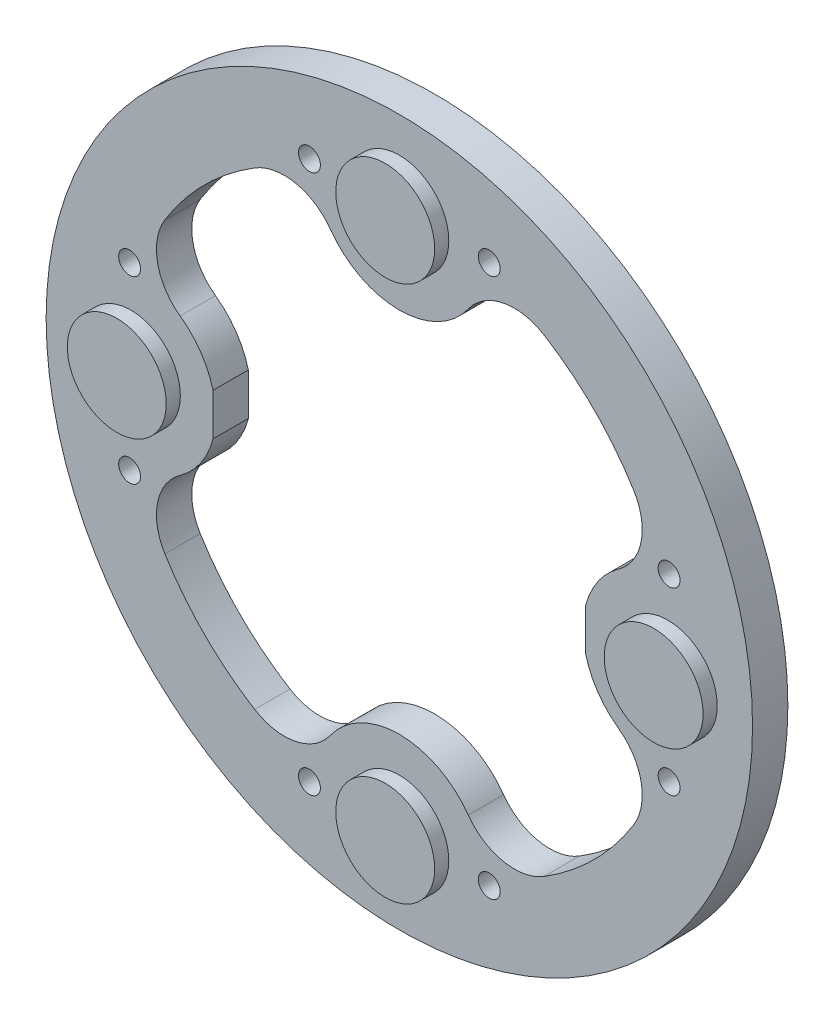
ISO-10303-21;
HEADER;
FILE_DESCRIPTION(('STEP AP214'),'2;1');
FILE_NAME('part.step','',(''),(''),'','','');
FILE_SCHEMA(('AUTOMOTIVE_DESIGN { 1 0 10303 214 1 1 1 1 }'));
ENDSEC;
DATA;
#1=APPLICATION_CONTEXT('core data for automotive mechanical design processes');
#2=APPLICATION_PROTOCOL_DEFINITION('international standard','automotive_design',2000,#1);
#3=PRODUCT_CONTEXT('',#1,'mechanical');
#4=PRODUCT('Part','Part','',(#3));
#5=PRODUCT_RELATED_PRODUCT_CATEGORY('part','',(#4));
#6=PRODUCT_DEFINITION_FORMATION('','',#4);
#7=PRODUCT_DEFINITION_CONTEXT('part definition',#1,'design');
#8=PRODUCT_DEFINITION('design','',#6,#7);
#9=PRODUCT_DEFINITION_SHAPE('','',#8);
#10=(LENGTH_UNIT() NAMED_UNIT(*) SI_UNIT(.MILLI.,.METRE.));
#11=(NAMED_UNIT(*) PLANE_ANGLE_UNIT() SI_UNIT($,.RADIAN.));
#12=(NAMED_UNIT(*) SI_UNIT($,.STERADIAN.) SOLID_ANGLE_UNIT());
#13=UNCERTAINTY_MEASURE_WITH_UNIT(LENGTH_MEASURE(1.E-05),#10,'distance_accuracy_value','');
#14=(GEOMETRIC_REPRESENTATION_CONTEXT(3) GLOBAL_UNCERTAINTY_ASSIGNED_CONTEXT((#13)) GLOBAL_UNIT_ASSIGNED_CONTEXT((#10,
#11,#12)) REPRESENTATION_CONTEXT('',''));
#15=CARTESIAN_POINT('',(0.,0.,0.));
#16=DIRECTION('',(0.,0.,1.));
#17=DIRECTION('',(1.,0.,0.));
#18=AXIS2_PLACEMENT_3D('',#15,#16,#17);
#19=CARTESIAN_POINT('',(0.,0.,5.));
#20=DIRECTION('',(0.,0.,-1.));
#21=DIRECTION('',(-1.,0.,0.));
#22=AXIS2_PLACEMENT_3D('',#19,#20,#21);
#23=CYLINDRICAL_SURFACE('',#22,39.);
#24=CARTESIAN_POINT('',(0.,0.,0.));
#25=DIRECTION('',(0.,0.,1.));
#26=DIRECTION('',(1.,0.,0.));
#27=AXIS2_PLACEMENT_3D('',#24,#25,#26);
#28=CIRCLE('',#27,39.);
#29=CARTESIAN_POINT('',(-20.4802815372425,33.1897283531409,0.));
#30=VERTEX_POINT('',#29);
#31=CARTESIAN_POINT('',(-33.1897283531409,20.4802815372425,0.));
#32=VERTEX_POINT('',#31);
#33=EDGE_CURVE('E249',#30,#32,#28,.T.);
#34=ORIENTED_EDGE('',*,*,#33,.F.);
#35=DIRECTION('',(0.,0.,-1.));
#36=VECTOR('',#35,1.);
#37=CARTESIAN_POINT('',(-20.4802815372425,33.1897283531409,5.));
#38=LINE('',#37,#36);
#39=CARTESIAN_POINT('',(-20.4802815372425,33.1897283531409,5.));
#40=VERTEX_POINT('',#39);
#41=EDGE_CURVE('E11',#40,#30,#38,.T.);
#42=ORIENTED_EDGE('',*,*,#41,.F.);
#43=CARTESIAN_POINT('',(0.,0.,5.));
#44=DIRECTION('',(0.,0.,1.));
#45=DIRECTION('',(1.,0.,0.));
#46=AXIS2_PLACEMENT_3D('',#43,#44,#45);
#47=CIRCLE('',#46,39.);
#48=CARTESIAN_POINT('',(-33.1897283531409,20.4802815372425,5.));
#49=VERTEX_POINT('',#48);
#50=EDGE_CURVE('E239',#40,#49,#47,.T.);
#51=ORIENTED_EDGE('',*,*,#50,.T.);
#52=DIRECTION('',(0.,0.,-1.));
#53=VECTOR('',#52,1.);
#54=CARTESIAN_POINT('',(-33.1897283531409,20.4802815372425,5.));
#55=LINE('',#54,#53);
#56=EDGE_CURVE('E50',#49,#32,#55,.T.);
#57=ORIENTED_EDGE('',*,*,#56,.T.);
#58=EDGE_LOOP('',(#34,#42,#51,#57));
#59=FACE_BOUND('',#58,.T.);
#60=ADVANCED_FACE('F34',(#59),#23,.F.);
#61=CARTESIAN_POINT('',(-16.2791981449876,26.3815789473684,5.));
#62=DIRECTION('',(0.,0.,-1.));
#63=DIRECTION('',(-1.,0.,0.));
#64=AXIS2_PLACEMENT_3D('',#61,#62,#63);
#65=CYLINDRICAL_SURFACE('',#64,8.);
#66=CARTESIAN_POINT('',(-16.2791981449876,26.3815789473684,0.));
#67=DIRECTION('',(0.,0.,1.));
#68=DIRECTION('',(1.,0.,0.));
#69=AXIS2_PLACEMENT_3D('',#66,#67,#68);
#70=CIRCLE('',#69,8.);
#71=CARTESIAN_POINT('',(-9.76751888699255,31.0289473684211,0.));
#72=VERTEX_POINT('',#71);
#73=EDGE_CURVE('E364',#30,#72,#70,.F.);
#74=ORIENTED_EDGE('',*,*,#73,.T.);
#75=DIRECTION('',(0.,0.,-1.));
#76=VECTOR('',#75,1.);
#77=CARTESIAN_POINT('',(-9.76751888699255,31.0289473684211,5.));
#78=LINE('',#77,#76);
#79=CARTESIAN_POINT('',(-9.76751888699255,31.0289473684211,5.));
#80=VERTEX_POINT('',#79);
#81=EDGE_CURVE('E42',#80,#72,#78,.T.);
#82=ORIENTED_EDGE('',*,*,#81,.F.);
#83=CARTESIAN_POINT('',(-16.2791981449876,26.3815789473684,5.));
#84=DIRECTION('',(0.,0.,1.));
#85=DIRECTION('',(1.,0.,0.));
#86=AXIS2_PLACEMENT_3D('',#83,#84,#85);
#87=CIRCLE('',#86,8.);
#88=EDGE_CURVE('E237',#40,#80,#87,.F.);
#89=ORIENTED_EDGE('',*,*,#88,.F.);
#90=ORIENTED_EDGE('',*,*,#41,.T.);
#91=EDGE_LOOP('',(#74,#82,#89,#90));
#92=FACE_BOUND('',#91,.T.);
#93=ADVANCED_FACE('F355',(#92),#65,.F.);
#94=CARTESIAN_POINT('',(0.,38.,5.));
#95=DIRECTION('',(0.,0.,-1.));
#96=DIRECTION('',(-1.,0.,0.));
#97=AXIS2_PLACEMENT_3D('',#94,#95,#96);
#98=CYLINDRICAL_SURFACE('',#97,12.);
#99=CARTESIAN_POINT('',(0.,38.,0.));
#100=DIRECTION('',(0.,0.,1.));
#101=DIRECTION('',(1.,0.,0.));
#102=AXIS2_PLACEMENT_3D('',#99,#100,#101);
#103=CIRCLE('',#102,12.);
#104=CARTESIAN_POINT('',(9.76751888699255,31.0289473684211,0.));
#105=VERTEX_POINT('',#104);
#106=EDGE_CURVE('E366',#72,#105,#103,.T.);
#107=ORIENTED_EDGE('',*,*,#106,.T.);
#108=DIRECTION('',(0.,0.,-1.));
#109=VECTOR('',#108,1.);
#110=CARTESIAN_POINT('',(9.76751888699255,31.0289473684211,5.));
#111=LINE('',#110,#109);
#112=CARTESIAN_POINT('',(9.76751888699255,31.0289473684211,5.));
#113=VERTEX_POINT('',#112);
#114=EDGE_CURVE('E446',#113,#105,#111,.T.);
#115=ORIENTED_EDGE('',*,*,#114,.F.);
#116=CARTESIAN_POINT('',(0.,38.,5.));
#117=DIRECTION('',(0.,0.,1.));
#118=DIRECTION('',(1.,0.,0.));
#119=AXIS2_PLACEMENT_3D('',#116,#117,#118);
#120=CIRCLE('',#119,12.);
#121=EDGE_CURVE('E235',#80,#113,#120,.T.);
#122=ORIENTED_EDGE('',*,*,#121,.F.);
#123=ORIENTED_EDGE('',*,*,#81,.T.);
#124=EDGE_LOOP('',(#107,#115,#122,#123));
#125=FACE_BOUND('',#124,.T.);
#126=ADVANCED_FACE('F359',(#125),#98,.T.);
#127=CARTESIAN_POINT('',(16.2791981449876,26.3815789473684,5.));
#128=DIRECTION('',(0.,0.,-1.));
#129=DIRECTION('',(-1.,0.,0.));
#130=AXIS2_PLACEMENT_3D('',#127,#128,#129);
#131=CYLINDRICAL_SURFACE('',#130,8.);
#132=CARTESIAN_POINT('',(16.2791981449876,26.3815789473684,0.));
#133=DIRECTION('',(0.,0.,1.));
#134=DIRECTION('',(1.,0.,0.));
#135=AXIS2_PLACEMENT_3D('',#132,#133,#134);
#136=CIRCLE('',#135,8.);
#137=CARTESIAN_POINT('',(20.4802815372424,33.1897283531409,0.));
#138=VERTEX_POINT('',#137);
#139=EDGE_CURVE('E372',#138,#105,#136,.T.);
#140=ORIENTED_EDGE('',*,*,#139,.F.);
#141=DIRECTION('',(0.,0.,-1.));
#142=VECTOR('',#141,1.);
#143=CARTESIAN_POINT('',(20.4802815372424,33.1897283531409,5.));
#144=LINE('',#143,#142);
#145=CARTESIAN_POINT('',(20.4802815372424,33.1897283531409,5.));
#146=VERTEX_POINT('',#145);
#147=EDGE_CURVE('E444',#146,#138,#144,.T.);
#148=ORIENTED_EDGE('',*,*,#147,.F.);
#149=CARTESIAN_POINT('',(16.2791981449876,26.3815789473684,5.));
#150=DIRECTION('',(0.,0.,1.));
#151=DIRECTION('',(1.,0.,0.));
#152=AXIS2_PLACEMENT_3D('',#149,#150,#151);
#153=CIRCLE('',#152,8.);
#154=EDGE_CURVE('E232',#146,#113,#153,.T.);
#155=ORIENTED_EDGE('',*,*,#154,.T.);
#156=ORIENTED_EDGE('',*,*,#114,.T.);
#157=EDGE_LOOP('',(#140,#148,#155,#156));
#158=FACE_BOUND('',#157,.T.);
#159=ADVANCED_FACE('F458',(#158),#131,.F.);
#160=CARTESIAN_POINT('',(0.,0.,5.));
#161=DIRECTION('',(0.,0.,-1.));
#162=DIRECTION('',(-1.,0.,0.));
#163=AXIS2_PLACEMENT_3D('',#160,#161,#162);
#164=CYLINDRICAL_SURFACE('',#163,39.);
#165=CARTESIAN_POINT('',(0.,0.,0.));
#166=DIRECTION('',(0.,0.,1.));
#167=DIRECTION('',(1.,0.,0.));
#168=AXIS2_PLACEMENT_3D('',#165,#166,#167);
#169=CIRCLE('',#168,39.);
#170=CARTESIAN_POINT('',(33.1897283531409,20.4802815372425,0.));
#171=VERTEX_POINT('',#170);
#172=EDGE_CURVE('E375',#171,#138,#169,.T.);
#173=ORIENTED_EDGE('',*,*,#172,.F.);
#174=DIRECTION('',(0.,0.,-1.));
#175=VECTOR('',#174,1.);
#176=CARTESIAN_POINT('',(33.1897283531409,20.4802815372425,5.));
#177=LINE('',#176,#175);
#178=CARTESIAN_POINT('',(33.1897283531409,20.4802815372425,5.));
#179=VERTEX_POINT('',#178);
#180=EDGE_CURVE('E442',#179,#171,#177,.T.);
#181=ORIENTED_EDGE('',*,*,#180,.F.);
#182=CARTESIAN_POINT('',(0.,0.,5.));
#183=DIRECTION('',(0.,0.,1.));
#184=DIRECTION('',(1.,0.,0.));
#185=AXIS2_PLACEMENT_3D('',#182,#183,#184);
#186=CIRCLE('',#185,39.);
#187=EDGE_CURVE('E229',#179,#146,#186,.T.);
#188=ORIENTED_EDGE('',*,*,#187,.T.);
#189=ORIENTED_EDGE('',*,*,#147,.T.);
#190=EDGE_LOOP('',(#173,#181,#188,#189));
#191=FACE_BOUND('',#190,.T.);
#192=ADVANCED_FACE('F462',(#191),#164,.F.);
#193=CARTESIAN_POINT('',(26.3815789473684,16.2791981449876,5.));
#194=DIRECTION('',(0.,0.,-1.));
#195=DIRECTION('',(-1.,0.,0.));
#196=AXIS2_PLACEMENT_3D('',#193,#194,#195);
#197=CYLINDRICAL_SURFACE('',#196,8.);
#198=CARTESIAN_POINT('',(26.3815789473684,16.2791981449876,0.));
#199=DIRECTION('',(0.,0.,1.));
#200=DIRECTION('',(1.,0.,0.));
#201=AXIS2_PLACEMENT_3D('',#198,#199,#200);
#202=CIRCLE('',#201,8.);
#203=CARTESIAN_POINT('',(31.0289473684211,9.76751888699255,0.));
#204=VERTEX_POINT('',#203);
#205=EDGE_CURVE('E378',#171,#204,#202,.F.);
#206=ORIENTED_EDGE('',*,*,#205,.T.);
#207=DIRECTION('',(0.,0.,-1.));
#208=VECTOR('',#207,1.);
#209=CARTESIAN_POINT('',(31.0289473684211,9.76751888699255,5.));
#210=LINE('',#209,#208);
#211=CARTESIAN_POINT('',(31.0289473684211,9.76751888699255,5.));
#212=VERTEX_POINT('',#211);
#213=EDGE_CURVE('E439',#212,#204,#210,.T.);
#214=ORIENTED_EDGE('',*,*,#213,.F.);
#215=CARTESIAN_POINT('',(26.3815789473684,16.2791981449876,5.));
#216=DIRECTION('',(0.,0.,1.));
#217=DIRECTION('',(1.,0.,0.));
#218=AXIS2_PLACEMENT_3D('',#215,#216,#217);
#219=CIRCLE('',#218,8.);
#220=EDGE_CURVE('E227',#179,#212,#219,.F.);
#221=ORIENTED_EDGE('',*,*,#220,.F.);
#222=ORIENTED_EDGE('',*,*,#180,.T.);
#223=EDGE_LOOP('',(#206,#214,#221,#222));
#224=FACE_BOUND('',#223,.T.);
#225=ADVANCED_FACE('F466',(#224),#197,.F.);
#226=CARTESIAN_POINT('',(38.,0.,5.));
#227=DIRECTION('',(0.,0.,-1.));
#228=DIRECTION('',(-1.,0.,0.));
#229=AXIS2_PLACEMENT_3D('',#226,#227,#228);
#230=CYLINDRICAL_SURFACE('',#229,12.);
#231=CARTESIAN_POINT('',(38.,0.,0.));
#232=DIRECTION('',(0.,0.,1.));
#233=DIRECTION('',(1.,0.,0.));
#234=AXIS2_PLACEMENT_3D('',#231,#232,#233);
#235=CIRCLE('',#234,12.);
#236=CARTESIAN_POINT('',(26.375,2.97647022494772,0.));
#237=VERTEX_POINT('',#236);
#238=EDGE_CURVE('E380',#204,#237,#235,.T.);
#239=ORIENTED_EDGE('',*,*,#238,.T.);
#240=DIRECTION('',(0.,0.,-1.));
#241=VECTOR('',#240,1.);
#242=CARTESIAN_POINT('',(26.375,2.97647022494772,5.));
#243=LINE('',#242,#241);
#244=CARTESIAN_POINT('',(26.375,2.97647022494772,5.));
#245=VERTEX_POINT('',#244);
#246=EDGE_CURVE('E436',#245,#237,#243,.T.);
#247=ORIENTED_EDGE('',*,*,#246,.F.);
#248=CARTESIAN_POINT('',(38.,0.,5.));
#249=DIRECTION('',(0.,0.,1.));
#250=DIRECTION('',(1.,0.,0.));
#251=AXIS2_PLACEMENT_3D('',#248,#249,#250);
#252=CIRCLE('',#251,12.);
#253=EDGE_CURVE('E225',#212,#245,#252,.T.);
#254=ORIENTED_EDGE('',*,*,#253,.F.);
#255=ORIENTED_EDGE('',*,*,#213,.T.);
#256=EDGE_LOOP('',(#239,#247,#254,#255));
#257=FACE_BOUND('',#256,.T.);
#258=ADVANCED_FACE('F472',(#257),#230,.T.);
#259=CARTESIAN_POINT('',(26.375,0.,5.));
#260=DIRECTION('',(1.,0.,0.));
#261=DIRECTION('',(0.,1.,0.));
#262=AXIS2_PLACEMENT_3D('',#259,#260,#261);
#263=PLANE('',#262);
#264=DIRECTION('',(0.,-1.,0.));
#265=VECTOR('',#264,1.);
#266=CARTESIAN_POINT('',(26.375,0.,0.));
#267=LINE('',#266,#265);
#268=CARTESIAN_POINT('',(26.375,-2.97647022494771,0.));
#269=VERTEX_POINT('',#268);
#270=EDGE_CURVE('E382',#237,#269,#267,.T.);
#271=ORIENTED_EDGE('',*,*,#270,.T.);
#272=DIRECTION('',(0.,0.,-1.));
#273=VECTOR('',#272,1.);
#274=CARTESIAN_POINT('',(26.375,-2.97647022494771,5.));
#275=LINE('',#274,#273);
#276=CARTESIAN_POINT('',(26.375,-2.97647022494771,5.));
#277=VERTEX_POINT('',#276);
#278=EDGE_CURVE('E433',#277,#269,#275,.T.);
#279=ORIENTED_EDGE('',*,*,#278,.F.);
#280=DIRECTION('',(0.,-1.,0.));
#281=VECTOR('',#280,1.);
#282=CARTESIAN_POINT('',(26.375,0.,5.));
#283=LINE('',#282,#281);
#284=EDGE_CURVE('E223',#245,#277,#283,.T.);
#285=ORIENTED_EDGE('',*,*,#284,.F.);
#286=ORIENTED_EDGE('',*,*,#246,.T.);
#287=EDGE_LOOP('',(#271,#279,#285,#286));
#288=FACE_BOUND('',#287,.T.);
#289=ADVANCED_FACE('F476',(#288),#263,.F.);
#290=CARTESIAN_POINT('',(31.0289473684211,-9.76751888699255,0.));
#291=VERTEX_POINT('',#290);
#292=EDGE_CURVE('E383',#269,#291,#235,.T.);
#293=ORIENTED_EDGE('',*,*,#292,.T.);
#294=DIRECTION('',(0.,0.,-1.));
#295=VECTOR('',#294,1.);
#296=CARTESIAN_POINT('',(31.0289473684211,-9.76751888699255,5.));
#297=LINE('',#296,#295);
#298=CARTESIAN_POINT('',(31.0289473684211,-9.76751888699255,5.));
#299=VERTEX_POINT('',#298);
#300=EDGE_CURVE('E431',#299,#291,#297,.T.);
#301=ORIENTED_EDGE('',*,*,#300,.F.);
#302=EDGE_CURVE('E222',#277,#299,#252,.T.);
#303=ORIENTED_EDGE('',*,*,#302,.F.);
#304=ORIENTED_EDGE('',*,*,#278,.T.);
#305=EDGE_LOOP('',(#293,#301,#303,#304));
#306=FACE_BOUND('',#305,.T.);
#307=ADVANCED_FACE('F482',(#306),#230,.T.);
#308=CARTESIAN_POINT('',(26.3815789473684,-16.2791981449876,5.));
#309=DIRECTION('',(0.,0.,-1.));
#310=DIRECTION('',(-1.,0.,0.));
#311=AXIS2_PLACEMENT_3D('',#308,#309,#310);
#312=CYLINDRICAL_SURFACE('',#311,8.);
#313=CARTESIAN_POINT('',(26.3815789473684,-16.2791981449876,0.));
#314=DIRECTION('',(0.,0.,1.));
#315=DIRECTION('',(1.,0.,0.));
#316=AXIS2_PLACEMENT_3D('',#313,#314,#315);
#317=CIRCLE('',#316,8.);
#318=CARTESIAN_POINT('',(33.1897283531409,-20.4802815372425,0.));
#319=VERTEX_POINT('',#318);
#320=EDGE_CURVE('E385',#319,#291,#317,.T.);
#321=ORIENTED_EDGE('',*,*,#320,.F.);
#322=DIRECTION('',(0.,0.,-1.));
#323=VECTOR('',#322,1.);
#324=CARTESIAN_POINT('',(33.1897283531409,-20.4802815372425,5.));
#325=LINE('',#324,#323);
#326=CARTESIAN_POINT('',(33.1897283531409,-20.4802815372425,5.));
#327=VERTEX_POINT('',#326);
#328=EDGE_CURVE('E429',#327,#319,#325,.T.);
#329=ORIENTED_EDGE('',*,*,#328,.F.);
#330=CARTESIAN_POINT('',(26.3815789473684,-16.2791981449876,5.));
#331=DIRECTION('',(0.,0.,1.));
#332=DIRECTION('',(1.,0.,0.));
#333=AXIS2_PLACEMENT_3D('',#330,#331,#332);
#334=CIRCLE('',#333,8.);
#335=EDGE_CURVE('E219',#327,#299,#334,.T.);
#336=ORIENTED_EDGE('',*,*,#335,.T.);
#337=ORIENTED_EDGE('',*,*,#300,.T.);
#338=EDGE_LOOP('',(#321,#329,#336,#337));
#339=FACE_BOUND('',#338,.T.);
#340=ADVANCED_FACE('F538',(#339),#312,.F.);
#341=CARTESIAN_POINT('',(0.,0.,5.));
#342=DIRECTION('',(0.,0.,-1.));
#343=DIRECTION('',(-1.,0.,0.));
#344=AXIS2_PLACEMENT_3D('',#341,#342,#343);
#345=CYLINDRICAL_SURFACE('',#344,39.);
#346=CARTESIAN_POINT('',(0.,0.,0.));
#347=DIRECTION('',(0.,0.,1.));
#348=DIRECTION('',(1.,0.,0.));
#349=AXIS2_PLACEMENT_3D('',#346,#347,#348);
#350=CIRCLE('',#349,39.);
#351=CARTESIAN_POINT('',(20.4802815372425,-33.1897283531409,0.));
#352=VERTEX_POINT('',#351);
#353=EDGE_CURVE('E388',#352,#319,#350,.T.);
#354=ORIENTED_EDGE('',*,*,#353,.F.);
#355=DIRECTION('',(0.,0.,-1.));
#356=VECTOR('',#355,1.);
#357=CARTESIAN_POINT('',(20.4802815372425,-33.1897283531409,5.));
#358=LINE('',#357,#356);
#359=CARTESIAN_POINT('',(20.4802815372425,-33.1897283531409,5.));
#360=VERTEX_POINT('',#359);
#361=EDGE_CURVE('E427',#360,#352,#358,.T.);
#362=ORIENTED_EDGE('',*,*,#361,.F.);
#363=CARTESIAN_POINT('',(0.,0.,5.));
#364=DIRECTION('',(0.,0.,1.));
#365=DIRECTION('',(1.,0.,0.));
#366=AXIS2_PLACEMENT_3D('',#363,#364,#365);
#367=CIRCLE('',#366,39.);
#368=EDGE_CURVE('E216',#360,#327,#367,.T.);
#369=ORIENTED_EDGE('',*,*,#368,.T.);
#370=ORIENTED_EDGE('',*,*,#328,.T.);
#371=EDGE_LOOP('',(#354,#362,#369,#370));
#372=FACE_BOUND('',#371,.T.);
#373=ADVANCED_FACE('F488',(#372),#345,.F.);
#374=CARTESIAN_POINT('',(16.2791981449876,-26.3815789473684,5.));
#375=DIRECTION('',(0.,0.,-1.));
#376=DIRECTION('',(-1.,0.,0.));
#377=AXIS2_PLACEMENT_3D('',#374,#375,#376);
#378=CYLINDRICAL_SURFACE('',#377,8.);
#379=CARTESIAN_POINT('',(16.2791981449876,-26.3815789473684,0.));
#380=DIRECTION('',(0.,0.,1.));
#381=DIRECTION('',(1.,0.,0.));
#382=AXIS2_PLACEMENT_3D('',#379,#380,#381);
#383=CIRCLE('',#382,8.);
#384=CARTESIAN_POINT('',(9.76751888699256,-31.0289473684211,0.));
#385=VERTEX_POINT('',#384);
#386=EDGE_CURVE('E391',#352,#385,#383,.F.);
#387=ORIENTED_EDGE('',*,*,#386,.T.);
#388=DIRECTION('',(0.,0.,-1.));
#389=VECTOR('',#388,1.);
#390=CARTESIAN_POINT('',(9.76751888699256,-31.0289473684211,5.));
#391=LINE('',#390,#389);
#392=CARTESIAN_POINT('',(9.76751888699256,-31.0289473684211,5.));
#393=VERTEX_POINT('',#392);
#394=EDGE_CURVE('E424',#393,#385,#391,.T.);
#395=ORIENTED_EDGE('',*,*,#394,.F.);
#396=CARTESIAN_POINT('',(16.2791981449876,-26.3815789473684,5.));
#397=DIRECTION('',(0.,0.,1.));
#398=DIRECTION('',(1.,0.,0.));
#399=AXIS2_PLACEMENT_3D('',#396,#397,#398);
#400=CIRCLE('',#399,8.);
#401=EDGE_CURVE('E214',#360,#393,#400,.F.);
#402=ORIENTED_EDGE('',*,*,#401,.F.);
#403=ORIENTED_EDGE('',*,*,#361,.T.);
#404=EDGE_LOOP('',(#387,#395,#402,#403));
#405=FACE_BOUND('',#404,.T.);
#406=ADVANCED_FACE('F494',(#405),#378,.F.);
#407=CARTESIAN_POINT('',(0.,-38.,5.));
#408=DIRECTION('',(0.,0.,-1.));
#409=DIRECTION('',(-1.,0.,0.));
#410=AXIS2_PLACEMENT_3D('',#407,#408,#409);
#411=CYLINDRICAL_SURFACE('',#410,12.);
#412=CARTESIAN_POINT('',(0.,-38.,0.));
#413=DIRECTION('',(0.,0.,1.));
#414=DIRECTION('',(1.,0.,0.));
#415=AXIS2_PLACEMENT_3D('',#412,#413,#414);
#416=CIRCLE('',#415,12.);
#417=CARTESIAN_POINT('',(-9.76751888699254,-31.0289473684211,0.));
#418=VERTEX_POINT('',#417);
#419=EDGE_CURVE('E393',#385,#418,#416,.T.);
#420=ORIENTED_EDGE('',*,*,#419,.T.);
#421=DIRECTION('',(0.,0.,-1.));
#422=VECTOR('',#421,1.);
#423=CARTESIAN_POINT('',(-9.76751888699254,-31.0289473684211,5.));
#424=LINE('',#423,#422);
#425=CARTESIAN_POINT('',(-9.76751888699254,-31.0289473684211,5.));
#426=VERTEX_POINT('',#425);
#427=EDGE_CURVE('E422',#426,#418,#424,.T.);
#428=ORIENTED_EDGE('',*,*,#427,.F.);
#429=CARTESIAN_POINT('',(0.,-38.,5.));
#430=DIRECTION('',(0.,0.,1.));
#431=DIRECTION('',(1.,0.,0.));
#432=AXIS2_PLACEMENT_3D('',#429,#430,#431);
#433=CIRCLE('',#432,12.);
#434=EDGE_CURVE('E212',#393,#426,#433,.T.);
#435=ORIENTED_EDGE('',*,*,#434,.F.);
#436=ORIENTED_EDGE('',*,*,#394,.T.);
#437=EDGE_LOOP('',(#420,#428,#435,#436));
#438=FACE_BOUND('',#437,.T.);
#439=ADVANCED_FACE('F499',(#438),#411,.T.);
#440=CARTESIAN_POINT('',(-16.2791981449876,-26.3815789473684,5.));
#441=DIRECTION('',(0.,0.,-1.));
#442=DIRECTION('',(-1.,0.,0.));
#443=AXIS2_PLACEMENT_3D('',#440,#441,#442);
#444=CYLINDRICAL_SURFACE('',#443,8.);
#445=CARTESIAN_POINT('',(-16.2791981449876,-26.3815789473684,0.));
#446=DIRECTION('',(0.,0.,1.));
#447=DIRECTION('',(1.,0.,0.));
#448=AXIS2_PLACEMENT_3D('',#445,#446,#447);
#449=CIRCLE('',#448,8.);
#450=CARTESIAN_POINT('',(-20.4802815372425,-33.1897283531409,0.));
#451=VERTEX_POINT('',#450);
#452=EDGE_CURVE('E396',#451,#418,#449,.T.);
#453=ORIENTED_EDGE('',*,*,#452,.F.);
#454=DIRECTION('',(0.,0.,-1.));
#455=VECTOR('',#454,1.);
#456=CARTESIAN_POINT('',(-20.4802815372425,-33.1897283531409,5.));
#457=LINE('',#456,#455);
#458=CARTESIAN_POINT('',(-20.4802815372425,-33.1897283531409,5.));
#459=VERTEX_POINT('',#458);
#460=EDGE_CURVE('E420',#459,#451,#457,.T.);
#461=ORIENTED_EDGE('',*,*,#460,.F.);
#462=CARTESIAN_POINT('',(-16.2791981449876,-26.3815789473684,5.));
#463=DIRECTION('',(0.,0.,1.));
#464=DIRECTION('',(1.,0.,0.));
#465=AXIS2_PLACEMENT_3D('',#462,#463,#464);
#466=CIRCLE('',#465,8.);
#467=EDGE_CURVE('E207',#459,#426,#466,.T.);
#468=ORIENTED_EDGE('',*,*,#467,.T.);
#469=ORIENTED_EDGE('',*,*,#427,.T.);
#470=EDGE_LOOP('',(#453,#461,#468,#469));
#471=FACE_BOUND('',#470,.T.);
#472=ADVANCED_FACE('F503',(#471),#444,.F.);
#473=CARTESIAN_POINT('',(0.,0.,5.));
#474=DIRECTION('',(0.,0.,-1.));
#475=DIRECTION('',(-1.,0.,0.));
#476=AXIS2_PLACEMENT_3D('',#473,#474,#475);
#477=CYLINDRICAL_SURFACE('',#476,39.);
#478=CARTESIAN_POINT('',(0.,0.,0.));
#479=DIRECTION('',(0.,0.,1.));
#480=DIRECTION('',(1.,0.,0.));
#481=AXIS2_PLACEMENT_3D('',#478,#479,#480);
#482=CIRCLE('',#481,39.);
#483=CARTESIAN_POINT('',(-33.1897283531409,-20.4802815372424,0.));
#484=VERTEX_POINT('',#483);
#485=EDGE_CURVE('E399',#484,#451,#482,.T.);
#486=ORIENTED_EDGE('',*,*,#485,.F.);
#487=DIRECTION('',(0.,0.,-1.));
#488=VECTOR('',#487,1.);
#489=CARTESIAN_POINT('',(-33.1897283531409,-20.4802815372424,5.));
#490=LINE('',#489,#488);
#491=CARTESIAN_POINT('',(-33.1897283531409,-20.4802815372424,5.));
#492=VERTEX_POINT('',#491);
#493=EDGE_CURVE('E418',#492,#484,#490,.T.);
#494=ORIENTED_EDGE('',*,*,#493,.F.);
#495=CARTESIAN_POINT('',(0.,0.,5.));
#496=DIRECTION('',(0.,0.,1.));
#497=DIRECTION('',(1.,0.,0.));
#498=AXIS2_PLACEMENT_3D('',#495,#496,#497);
#499=CIRCLE('',#498,39.);
#500=EDGE_CURVE('E202',#492,#459,#499,.T.);
#501=ORIENTED_EDGE('',*,*,#500,.T.);
#502=ORIENTED_EDGE('',*,*,#460,.T.);
#503=EDGE_LOOP('',(#486,#494,#501,#502));
#504=FACE_BOUND('',#503,.T.);
#505=ADVANCED_FACE('F506',(#504),#477,.F.);
#506=CARTESIAN_POINT('',(-26.3815789473684,-16.2791981449876,5.));
#507=DIRECTION('',(0.,0.,-1.));
#508=DIRECTION('',(-1.,0.,0.));
#509=AXIS2_PLACEMENT_3D('',#506,#507,#508);
#510=CYLINDRICAL_SURFACE('',#509,8.);
#511=CARTESIAN_POINT('',(-26.3815789473684,-16.2791981449876,0.));
#512=DIRECTION('',(0.,0.,1.));
#513=DIRECTION('',(1.,0.,0.));
#514=AXIS2_PLACEMENT_3D('',#511,#512,#513);
#515=CIRCLE('',#514,8.);
#516=CARTESIAN_POINT('',(-31.0289473684211,-9.76751888699255,0.));
#517=VERTEX_POINT('',#516);
#518=EDGE_CURVE('E402',#484,#517,#515,.F.);
#519=ORIENTED_EDGE('',*,*,#518,.T.);
#520=DIRECTION('',(0.,0.,-1.));
#521=VECTOR('',#520,1.);
#522=CARTESIAN_POINT('',(-31.0289473684211,-9.76751888699255,5.));
#523=LINE('',#522,#521);
#524=CARTESIAN_POINT('',(-31.0289473684211,-9.76751888699255,5.));
#525=VERTEX_POINT('',#524);
#526=EDGE_CURVE('E415',#525,#517,#523,.T.);
#527=ORIENTED_EDGE('',*,*,#526,.F.);
#528=CARTESIAN_POINT('',(-26.3815789473684,-16.2791981449876,5.));
#529=DIRECTION('',(0.,0.,1.));
#530=DIRECTION('',(1.,0.,0.));
#531=AXIS2_PLACEMENT_3D('',#528,#529,#530);
#532=CIRCLE('',#531,8.);
#533=EDGE_CURVE('E201',#492,#525,#532,.F.);
#534=ORIENTED_EDGE('',*,*,#533,.F.);
#535=ORIENTED_EDGE('',*,*,#493,.T.);
#536=EDGE_LOOP('',(#519,#527,#534,#535));
#537=FACE_BOUND('',#536,.T.);
#538=ADVANCED_FACE('F509',(#537),#510,.F.);
#539=CARTESIAN_POINT('',(-38.,0.,5.));
#540=DIRECTION('',(0.,0.,-1.));
#541=DIRECTION('',(-1.,0.,0.));
#542=AXIS2_PLACEMENT_3D('',#539,#540,#541);
#543=CYLINDRICAL_SURFACE('',#542,12.);
#544=CARTESIAN_POINT('',(-38.,0.,0.));
#545=DIRECTION('',(0.,0.,1.));
#546=DIRECTION('',(1.,0.,0.));
#547=AXIS2_PLACEMENT_3D('',#544,#545,#546);
#548=CIRCLE('',#547,12.);
#549=CARTESIAN_POINT('',(-26.375,-2.97647022494767,0.));
#550=VERTEX_POINT('',#549);
#551=EDGE_CURVE('E404',#517,#550,#548,.T.);
#552=ORIENTED_EDGE('',*,*,#551,.T.);
#553=DIRECTION('',(0.,0.,-1.));
#554=VECTOR('',#553,1.);
#555=CARTESIAN_POINT('',(-26.375,-2.97647022494767,5.));
#556=LINE('',#555,#554);
#557=CARTESIAN_POINT('',(-26.375,-2.97647022494767,5.));
#558=VERTEX_POINT('',#557);
#559=EDGE_CURVE('E193',#558,#550,#556,.T.);
#560=ORIENTED_EDGE('',*,*,#559,.F.);
#561=CARTESIAN_POINT('',(-38.,0.,5.));
#562=DIRECTION('',(0.,0.,1.));
#563=DIRECTION('',(1.,0.,0.));
#564=AXIS2_PLACEMENT_3D('',#561,#562,#563);
#565=CIRCLE('',#564,12.);
#566=EDGE_CURVE('E181',#525,#558,#565,.T.);
#567=ORIENTED_EDGE('',*,*,#566,.F.);
#568=ORIENTED_EDGE('',*,*,#526,.T.);
#569=EDGE_LOOP('',(#552,#560,#567,#568));
#570=FACE_BOUND('',#569,.T.);
#571=ADVANCED_FACE('F512',(#570),#543,.T.);
#572=CARTESIAN_POINT('',(-26.375,0.,5.));
#573=DIRECTION('',(-1.,0.,0.));
#574=DIRECTION('',(0.,-1.,0.));
#575=AXIS2_PLACEMENT_3D('',#572,#573,#574);
#576=PLANE('',#575);
#577=DIRECTION('',(0.,1.,0.));
#578=VECTOR('',#577,1.);
#579=CARTESIAN_POINT('',(-26.375,0.,0.));
#580=LINE('',#579,#578);
#581=CARTESIAN_POINT('',(-26.375,2.97647022494767,0.));
#582=VERTEX_POINT('',#581);
#583=EDGE_CURVE('E190',#550,#582,#580,.T.);
#584=ORIENTED_EDGE('',*,*,#583,.T.);
#585=DIRECTION('',(0.,0.,-1.));
#586=VECTOR('',#585,1.);
#587=CARTESIAN_POINT('',(-26.375,2.97647022494767,5.));
#588=LINE('',#587,#586);
#589=CARTESIAN_POINT('',(-26.375,2.97647022494767,5.));
#590=VERTEX_POINT('',#589);
#591=EDGE_CURVE('E187',#590,#582,#588,.T.);
#592=ORIENTED_EDGE('',*,*,#591,.F.);
#593=DIRECTION('',(0.,1.,0.));
#594=VECTOR('',#593,1.);
#595=CARTESIAN_POINT('',(-26.375,0.,5.));
#596=LINE('',#595,#594);
#597=EDGE_CURVE('E172',#558,#590,#596,.T.);
#598=ORIENTED_EDGE('',*,*,#597,.F.);
#599=ORIENTED_EDGE('',*,*,#559,.T.);
#600=EDGE_LOOP('',(#584,#592,#598,#599));
#601=FACE_BOUND('',#600,.T.);
#602=ADVANCED_FACE('F188',(#601),#576,.F.);
#603=CARTESIAN_POINT('',(-31.0289473684211,9.76751888699255,0.));
#604=VERTEX_POINT('',#603);
#605=EDGE_CURVE('E406',#582,#604,#548,.T.);
#606=ORIENTED_EDGE('',*,*,#605,.T.);
#607=DIRECTION('',(0.,0.,-1.));
#608=VECTOR('',#607,1.);
#609=CARTESIAN_POINT('',(-31.0289473684211,9.76751888699255,5.));
#610=LINE('',#609,#608);
#611=CARTESIAN_POINT('',(-31.0289473684211,9.76751888699255,5.));
#612=VERTEX_POINT('',#611);
#613=EDGE_CURVE('E112',#612,#604,#610,.T.);
#614=ORIENTED_EDGE('',*,*,#613,.F.);
#615=EDGE_CURVE('E179',#590,#612,#565,.T.);
#616=ORIENTED_EDGE('',*,*,#615,.F.);
#617=ORIENTED_EDGE('',*,*,#591,.T.);
#618=EDGE_LOOP('',(#606,#614,#616,#617));
#619=FACE_BOUND('',#618,.T.);
#620=ADVANCED_FACE('F195',(#619),#543,.T.);
#621=CARTESIAN_POINT('',(-26.3815789473684,16.2791981449876,5.));
#622=DIRECTION('',(0.,0.,-1.));
#623=DIRECTION('',(-1.,0.,0.));
#624=AXIS2_PLACEMENT_3D('',#621,#622,#623);
#625=CYLINDRICAL_SURFACE('',#624,8.);
#626=CARTESIAN_POINT('',(-26.3815789473684,16.2791981449876,0.));
#627=DIRECTION('',(0.,0.,1.));
#628=DIRECTION('',(1.,0.,0.));
#629=AXIS2_PLACEMENT_3D('',#626,#627,#628);
#630=CIRCLE('',#629,8.);
#631=EDGE_CURVE('E408',#32,#604,#630,.T.);
#632=ORIENTED_EDGE('',*,*,#631,.F.);
#633=ORIENTED_EDGE('',*,*,#56,.F.);
#634=CARTESIAN_POINT('',(-26.3815789473684,16.2791981449876,5.));
#635=DIRECTION('',(0.,0.,1.));
#636=DIRECTION('',(1.,0.,0.));
#637=AXIS2_PLACEMENT_3D('',#634,#635,#636);
#638=CIRCLE('',#637,8.);
#639=EDGE_CURVE('E196',#49,#612,#638,.T.);
#640=ORIENTED_EDGE('',*,*,#639,.T.);
#641=ORIENTED_EDGE('',*,*,#613,.T.);
#642=EDGE_LOOP('',(#632,#633,#640,#641));
#643=FACE_BOUND('',#642,.T.);
#644=ADVANCED_FACE('F513',(#643),#625,.F.);
#645=CARTESIAN_POINT('',(0.,0.,5.));
#646=DIRECTION('',(0.,0.,-1.));
#647=DIRECTION('',(-1.,0.,0.));
#648=AXIS2_PLACEMENT_3D('',#645,#646,#647);
#649=CYLINDRICAL_SURFACE('',#648,50.);
#650=CARTESIAN_POINT('',(0.,0.,5.));
#651=DIRECTION('',(0.,0.,1.));
#652=DIRECTION('',(1.,0.,0.));
#653=AXIS2_PLACEMENT_3D('',#650,#651,#652);
#654=CIRCLE('',#653,50.);
#655=CARTESIAN_POINT('',(50.,0.,5.));
#656=VERTEX_POINT('',#655);
#657=EDGE_CURVE('E198',#656,#656,#654,.T.);
#658=ORIENTED_EDGE('',*,*,#657,.F.);
#659=EDGE_LOOP('',(#658));
#660=FACE_BOUND('',#659,.T.);
#661=CARTESIAN_POINT('',(0.,0.,0.));
#662=DIRECTION('',(0.,0.,1.));
#663=DIRECTION('',(1.,0.,0.));
#664=AXIS2_PLACEMENT_3D('',#661,#662,#663);
#665=CIRCLE('',#664,50.);
#666=CARTESIAN_POINT('',(50.,0.,0.));
#667=VERTEX_POINT('',#666);
#668=EDGE_CURVE('E241',#667,#667,#665,.T.);
#669=ORIENTED_EDGE('',*,*,#668,.T.);
#670=EDGE_LOOP('',(#669));
#671=FACE_BOUND('',#670,.T.);
#672=ADVANCED_FACE('F322',(#660,#671),#649,.T.);
#673=CARTESIAN_POINT('',(0.,0.,5.));
#674=DIRECTION('',(0.,0.,1.));
#675=DIRECTION('',(1.,0.,0.));
#676=AXIS2_PLACEMENT_3D('',#673,#674,#675);
#677=PLANE('',#676);
#678=CARTESIAN_POINT('',(-38.1837661840735,12.7279220613579,5.));
#679=DIRECTION('',(0.,0.,1.));
#680=DIRECTION('',(1.,0.,0.));
#681=AXIS2_PLACEMENT_3D('',#678,#679,#680);
#682=CIRCLE('',#681,1.55);
#683=CARTESIAN_POINT('',(-36.6337661840735,12.7279220613579,5.));
#684=VERTEX_POINT('',#683);
#685=EDGE_CURVE('E291',#684,#684,#682,.T.);
#686=ORIENTED_EDGE('',*,*,#685,.F.);
#687=EDGE_LOOP('',(#686));
#688=FACE_BOUND('',#687,.T.);
#689=CARTESIAN_POINT('',(38.1837661840736,12.7279220613578,5.));
#690=DIRECTION('',(0.,0.,1.));
#691=DIRECTION('',(1.,0.,0.));
#692=AXIS2_PLACEMENT_3D('',#689,#690,#691);
#693=CIRCLE('',#692,1.55);
#694=CARTESIAN_POINT('',(39.7337661840736,12.7279220613578,5.));
#695=VERTEX_POINT('',#694);
#696=EDGE_CURVE('E285',#695,#695,#693,.T.);
#697=ORIENTED_EDGE('',*,*,#696,.F.);
#698=EDGE_LOOP('',(#697));
#699=FACE_BOUND('',#698,.T.);
#700=CARTESIAN_POINT('',(12.7279220613578,-38.1837661840736,5.));
#701=DIRECTION('',(0.,0.,1.));
#702=DIRECTION('',(1.,0.,0.));
#703=AXIS2_PLACEMENT_3D('',#700,#701,#702);
#704=CIRCLE('',#703,1.55);
#705=CARTESIAN_POINT('',(14.2779220613578,-38.1837661840736,5.));
#706=VERTEX_POINT('',#705);
#707=EDGE_CURVE('E277',#706,#706,#704,.T.);
#708=ORIENTED_EDGE('',*,*,#707,.F.);
#709=EDGE_LOOP('',(#708));
#710=FACE_BOUND('',#709,.T.);
#711=CARTESIAN_POINT('',(-38.1837661840736,-12.7279220613578,5.));
#712=DIRECTION('',(0.,0.,1.));
#713=DIRECTION('',(1.,0.,0.));
#714=AXIS2_PLACEMENT_3D('',#711,#712,#713);
#715=CIRCLE('',#714,1.55);
#716=CARTESIAN_POINT('',(-36.6337661840736,-12.7279220613578,5.));
#717=VERTEX_POINT('',#716);
#718=EDGE_CURVE('E278',#717,#717,#715,.T.);
#719=ORIENTED_EDGE('',*,*,#718,.F.);
#720=EDGE_LOOP('',(#719));
#721=FACE_BOUND('',#720,.T.);
#722=CARTESIAN_POINT('',(12.7279220613579,38.1837661840735,5.));
#723=DIRECTION('',(0.,0.,1.));
#724=DIRECTION('',(1.,0.,0.));
#725=AXIS2_PLACEMENT_3D('',#722,#723,#724);
#726=CIRCLE('',#725,1.55);
#727=CARTESIAN_POINT('',(14.2779220613579,38.1837661840735,5.));
#728=VERTEX_POINT('',#727);
#729=EDGE_CURVE('E308',#728,#728,#726,.T.);
#730=ORIENTED_EDGE('',*,*,#729,.F.);
#731=EDGE_LOOP('',(#730));
#732=FACE_BOUND('',#731,.T.);
#733=CARTESIAN_POINT('',(38.1837661840735,-12.7279220613579,5.));
#734=DIRECTION('',(0.,0.,1.));
#735=DIRECTION('',(1.,0.,0.));
#736=AXIS2_PLACEMENT_3D('',#733,#734,#735);
#737=CIRCLE('',#736,1.55);
#738=CARTESIAN_POINT('',(39.7337661840735,-12.7279220613579,5.));
#739=VERTEX_POINT('',#738);
#740=EDGE_CURVE('E301',#739,#739,#737,.T.);
#741=ORIENTED_EDGE('',*,*,#740,.F.);
#742=EDGE_LOOP('',(#741));
#743=FACE_BOUND('',#742,.T.);
#744=CARTESIAN_POINT('',(-12.7279220613579,-38.1837661840735,5.));
#745=DIRECTION('',(0.,0.,1.));
#746=DIRECTION('',(1.,0.,0.));
#747=AXIS2_PLACEMENT_3D('',#744,#745,#746);
#748=CIRCLE('',#747,1.54999999999999);
#749=CARTESIAN_POINT('',(-11.1779220613579,-38.1837661840735,5.));
#750=VERTEX_POINT('',#749);
#751=EDGE_CURVE('E302',#750,#750,#748,.T.);
#752=ORIENTED_EDGE('',*,*,#751,.F.);
#753=EDGE_LOOP('',(#752));
#754=FACE_BOUND('',#753,.T.);
#755=CARTESIAN_POINT('',(-12.7279220613578,38.1837661840736,5.));
#756=DIRECTION('',(0.,0.,1.));
#757=DIRECTION('',(1.,0.,0.));
#758=AXIS2_PLACEMENT_3D('',#755,#756,#757);
#759=CIRCLE('',#758,1.55000000000001);
#760=CARTESIAN_POINT('',(-11.1779220613578,38.1837661840736,5.));
#761=VERTEX_POINT('',#760);
#762=EDGE_CURVE('E270',#761,#761,#759,.T.);
#763=ORIENTED_EDGE('',*,*,#762,.F.);
#764=EDGE_LOOP('',(#763));
#765=FACE_BOUND('',#764,.T.);
#766=CARTESIAN_POINT('',(0.,-38.,5.));
#767=DIRECTION('',(0.,0.,1.));
#768=DIRECTION('',(1.,0.,0.));
#769=AXIS2_PLACEMENT_3D('',#766,#767,#768);
#770=CIRCLE('',#769,6.99999999999999);
#771=CARTESIAN_POINT('',(7.,-38.,5.));
#772=VERTEX_POINT('',#771);
#773=EDGE_CURVE('E262',#772,#772,#770,.T.);
#774=ORIENTED_EDGE('',*,*,#773,.F.);
#775=EDGE_LOOP('',(#774));
#776=FACE_BOUND('',#775,.T.);
#777=CARTESIAN_POINT('',(38.,0.,5.));
#778=DIRECTION('',(0.,0.,1.));
#779=DIRECTION('',(1.,0.,0.));
#780=AXIS2_PLACEMENT_3D('',#777,#778,#779);
#781=CIRCLE('',#780,6.99999999999999);
#782=CARTESIAN_POINT('',(45.,0.,5.));
#783=VERTEX_POINT('',#782);
#784=EDGE_CURVE('E256',#783,#783,#781,.T.);
#785=ORIENTED_EDGE('',*,*,#784,.F.);
#786=EDGE_LOOP('',(#785));
#787=FACE_BOUND('',#786,.T.);
#788=CARTESIAN_POINT('',(0.,38.,5.));
#789=DIRECTION('',(0.,0.,1.));
#790=DIRECTION('',(1.,0.,0.));
#791=AXIS2_PLACEMENT_3D('',#788,#789,#790);
#792=CIRCLE('',#791,6.99999999999999);
#793=CARTESIAN_POINT('',(6.99999999999999,38.,5.));
#794=VERTEX_POINT('',#793);
#795=EDGE_CURVE('E250',#794,#794,#792,.T.);
#796=ORIENTED_EDGE('',*,*,#795,.F.);
#797=EDGE_LOOP('',(#796));
#798=FACE_BOUND('',#797,.T.);
#799=CARTESIAN_POINT('',(-38.,0.,5.));
#800=DIRECTION('',(0.,0.,1.));
#801=DIRECTION('',(1.,0.,0.));
#802=AXIS2_PLACEMENT_3D('',#799,#800,#801);
#803=CIRCLE('',#802,6.99999999999999);
#804=CARTESIAN_POINT('',(-31.,0.,5.));
#805=VERTEX_POINT('',#804);
#806=EDGE_CURVE('E242',#805,#805,#803,.T.);
#807=ORIENTED_EDGE('',*,*,#806,.F.);
#808=EDGE_LOOP('',(#807));
#809=FACE_BOUND('',#808,.T.);
#810=ORIENTED_EDGE('',*,*,#50,.F.);
#811=ORIENTED_EDGE('',*,*,#88,.T.);
#812=ORIENTED_EDGE('',*,*,#121,.T.);
#813=ORIENTED_EDGE('',*,*,#154,.F.);
#814=ORIENTED_EDGE('',*,*,#187,.F.);
#815=ORIENTED_EDGE('',*,*,#220,.T.);
#816=ORIENTED_EDGE('',*,*,#253,.T.);
#817=ORIENTED_EDGE('',*,*,#284,.T.);
#818=ORIENTED_EDGE('',*,*,#302,.T.);
#819=ORIENTED_EDGE('',*,*,#335,.F.);
#820=ORIENTED_EDGE('',*,*,#368,.F.);
#821=ORIENTED_EDGE('',*,*,#401,.T.);
#822=ORIENTED_EDGE('',*,*,#434,.T.);
#823=ORIENTED_EDGE('',*,*,#467,.F.);
#824=ORIENTED_EDGE('',*,*,#500,.F.);
#825=ORIENTED_EDGE('',*,*,#533,.T.);
#826=ORIENTED_EDGE('',*,*,#566,.T.);
#827=ORIENTED_EDGE('',*,*,#597,.T.);
#828=ORIENTED_EDGE('',*,*,#615,.T.);
#829=ORIENTED_EDGE('',*,*,#639,.F.);
#830=EDGE_LOOP('',(#810,#811,#812,#813,#814,#815,#816,#817,#818,#819,#820,#821,#822,#823,#824,
#825,#826,#827,#828,#829));
#831=FACE_BOUND('',#830,.T.);
#832=ORIENTED_EDGE('',*,*,#657,.T.);
#833=EDGE_LOOP('',(#832));
#834=FACE_BOUND('',#833,.T.);
#835=ADVANCED_FACE('F175',(#688,#699,#710,#721,#732,#743,#754,#765,#776,#787,#798,#809,#831,
#834),#677,.T.);
#836=CARTESIAN_POINT('',(0.,0.,0.));
#837=DIRECTION('',(0.,0.,1.));
#838=DIRECTION('',(1.,0.,0.));
#839=AXIS2_PLACEMENT_3D('',#836,#837,#838);
#840=PLANE('',#839);
#841=CARTESIAN_POINT('',(-38.1837661840735,12.7279220613579,0.));
#842=DIRECTION('',(0.,0.,1.));
#843=DIRECTION('',(1.,0.,0.));
#844=AXIS2_PLACEMENT_3D('',#841,#842,#843);
#845=CIRCLE('',#844,1.55);
#846=CARTESIAN_POINT('',(-36.6337661840735,12.7279220613579,0.));
#847=VERTEX_POINT('',#846);
#848=EDGE_CURVE('E273',#847,#847,#845,.F.);
#849=ORIENTED_EDGE('',*,*,#848,.F.);
#850=EDGE_LOOP('',(#849));
#851=FACE_BOUND('',#850,.T.);
#852=CARTESIAN_POINT('',(38.1837661840736,12.7279220613578,0.));
#853=DIRECTION('',(0.,0.,1.));
#854=DIRECTION('',(1.,0.,0.));
#855=AXIS2_PLACEMENT_3D('',#852,#853,#854);
#856=CIRCLE('',#855,1.55);
#857=CARTESIAN_POINT('',(39.7337661840736,12.7279220613578,0.));
#858=VERTEX_POINT('',#857);
#859=EDGE_CURVE('E288',#858,#858,#856,.F.);
#860=ORIENTED_EDGE('',*,*,#859,.F.);
#861=EDGE_LOOP('',(#860));
#862=FACE_BOUND('',#861,.T.);
#863=CARTESIAN_POINT('',(12.7279220613578,-38.1837661840736,0.));
#864=DIRECTION('',(0.,0.,1.));
#865=DIRECTION('',(1.,0.,0.));
#866=AXIS2_PLACEMENT_3D('',#863,#864,#865);
#867=CIRCLE('',#866,1.55);
#868=CARTESIAN_POINT('',(14.2779220613578,-38.1837661840736,0.));
#869=VERTEX_POINT('',#868);
#870=EDGE_CURVE('E282',#869,#869,#867,.F.);
#871=ORIENTED_EDGE('',*,*,#870,.F.);
#872=EDGE_LOOP('',(#871));
#873=FACE_BOUND('',#872,.T.);
#874=CARTESIAN_POINT('',(-38.1837661840736,-12.7279220613578,0.));
#875=DIRECTION('',(0.,0.,1.));
#876=DIRECTION('',(1.,0.,0.));
#877=AXIS2_PLACEMENT_3D('',#874,#875,#876);
#878=CIRCLE('',#877,1.55);
#879=CARTESIAN_POINT('',(-36.6337661840736,-12.7279220613578,0.));
#880=VERTEX_POINT('',#879);
#881=EDGE_CURVE('E274',#880,#880,#878,.F.);
#882=ORIENTED_EDGE('',*,*,#881,.F.);
#883=EDGE_LOOP('',(#882));
#884=FACE_BOUND('',#883,.T.);
#885=CARTESIAN_POINT('',(12.7279220613579,38.1837661840735,0.));
#886=DIRECTION('',(0.,0.,1.));
#887=DIRECTION('',(1.,0.,0.));
#888=AXIS2_PLACEMENT_3D('',#885,#886,#887);
#889=CIRCLE('',#888,1.55);
#890=CARTESIAN_POINT('',(14.2779220613579,38.1837661840735,0.));
#891=VERTEX_POINT('',#890);
#892=EDGE_CURVE('E281',#891,#891,#889,.F.);
#893=ORIENTED_EDGE('',*,*,#892,.F.);
#894=EDGE_LOOP('',(#893));
#895=FACE_BOUND('',#894,.T.);
#896=CARTESIAN_POINT('',(38.1837661840735,-12.7279220613579,0.));
#897=DIRECTION('',(0.,0.,1.));
#898=DIRECTION('',(1.,0.,0.));
#899=AXIS2_PLACEMENT_3D('',#896,#897,#898);
#900=CIRCLE('',#899,1.55);
#901=CARTESIAN_POINT('',(39.7337661840735,-12.7279220613579,0.));
#902=VERTEX_POINT('',#901);
#903=EDGE_CURVE('E305',#902,#902,#900,.F.);
#904=ORIENTED_EDGE('',*,*,#903,.F.);
#905=EDGE_LOOP('',(#904));
#906=FACE_BOUND('',#905,.T.);
#907=CARTESIAN_POINT('',(-12.7279220613579,-38.1837661840735,0.));
#908=DIRECTION('',(0.,0.,1.));
#909=DIRECTION('',(1.,0.,0.));
#910=AXIS2_PLACEMENT_3D('',#907,#908,#909);
#911=CIRCLE('',#910,1.54999999999999);
#912=CARTESIAN_POINT('',(-11.1779220613579,-38.1837661840735,0.));
#913=VERTEX_POINT('',#912);
#914=EDGE_CURVE('E298',#913,#913,#911,.F.);
#915=ORIENTED_EDGE('',*,*,#914,.F.);
#916=EDGE_LOOP('',(#915));
#917=FACE_BOUND('',#916,.T.);
#918=CARTESIAN_POINT('',(-12.7279220613578,38.1837661840736,0.));
#919=DIRECTION('',(0.,0.,1.));
#920=DIRECTION('',(1.,0.,0.));
#921=AXIS2_PLACEMENT_3D('',#918,#919,#920);
#922=CIRCLE('',#921,1.55000000000001);
#923=CARTESIAN_POINT('',(-11.1779220613578,38.1837661840736,0.));
#924=VERTEX_POINT('',#923);
#925=EDGE_CURVE('E265',#924,#924,#922,.F.);
#926=ORIENTED_EDGE('',*,*,#925,.F.);
#927=EDGE_LOOP('',(#926));
#928=FACE_BOUND('',#927,.T.);
#929=ORIENTED_EDGE('',*,*,#33,.T.);
#930=ORIENTED_EDGE('',*,*,#631,.T.);
#931=ORIENTED_EDGE('',*,*,#605,.F.);
#932=ORIENTED_EDGE('',*,*,#583,.F.);
#933=ORIENTED_EDGE('',*,*,#551,.F.);
#934=ORIENTED_EDGE('',*,*,#518,.F.);
#935=ORIENTED_EDGE('',*,*,#485,.T.);
#936=ORIENTED_EDGE('',*,*,#452,.T.);
#937=ORIENTED_EDGE('',*,*,#419,.F.);
#938=ORIENTED_EDGE('',*,*,#386,.F.);
#939=ORIENTED_EDGE('',*,*,#353,.T.);
#940=ORIENTED_EDGE('',*,*,#320,.T.);
#941=ORIENTED_EDGE('',*,*,#292,.F.);
#942=ORIENTED_EDGE('',*,*,#270,.F.);
#943=ORIENTED_EDGE('',*,*,#238,.F.);
#944=ORIENTED_EDGE('',*,*,#205,.F.);
#945=ORIENTED_EDGE('',*,*,#172,.T.);
#946=ORIENTED_EDGE('',*,*,#139,.T.);
#947=ORIENTED_EDGE('',*,*,#106,.F.);
#948=ORIENTED_EDGE('',*,*,#73,.F.);
#949=EDGE_LOOP('',(#929,#930,#931,#932,#933,#934,#935,#936,#937,#938,#939,#940,#941,#942,#943,
#944,#945,#946,#947,#948));
#950=FACE_BOUND('',#949,.T.);
#951=ORIENTED_EDGE('',*,*,#668,.F.);
#952=EDGE_LOOP('',(#951));
#953=FACE_BOUND('',#952,.T.);
#954=ADVANCED_FACE('F321',(#851,#862,#873,#884,#895,#906,#917,#928,#950,#953),#840,.F.);
#955=CARTESIAN_POINT('',(-38.,0.,7.));
#956=DIRECTION('',(0.,0.,-1.));
#957=DIRECTION('',(-1.,0.,0.));
#958=AXIS2_PLACEMENT_3D('',#955,#956,#957);
#959=CYLINDRICAL_SURFACE('',#958,6.99999999999999);
#960=CARTESIAN_POINT('',(-38.,0.,7.));
#961=DIRECTION('',(0.,0.,1.));
#962=DIRECTION('',(1.,0.,0.));
#963=AXIS2_PLACEMENT_3D('',#960,#961,#962);
#964=CIRCLE('',#963,6.99999999999999);
#965=CARTESIAN_POINT('',(-31.,0.,7.));
#966=VERTEX_POINT('',#965);
#967=EDGE_CURVE('E245',#966,#966,#964,.T.);
#968=ORIENTED_EDGE('',*,*,#967,.F.);
#969=EDGE_LOOP('',(#968));
#970=FACE_BOUND('',#969,.T.);
#971=ORIENTED_EDGE('',*,*,#806,.T.);
#972=EDGE_LOOP('',(#971));
#973=FACE_BOUND('',#972,.T.);
#974=ADVANCED_FACE('F339',(#970,#973),#959,.T.);
#975=CARTESIAN_POINT('',(-38.,0.,7.));
#976=DIRECTION('',(0.,0.,1.));
#977=DIRECTION('',(1.,0.,0.));
#978=AXIS2_PLACEMENT_3D('',#975,#976,#977);
#979=PLANE('',#978);
#980=ORIENTED_EDGE('',*,*,#967,.T.);
#981=EDGE_LOOP('',(#980));
#982=FACE_BOUND('',#981,.T.);
#983=ADVANCED_FACE('F341',(#982),#979,.T.);
#984=CARTESIAN_POINT('',(0.,38.,7.));
#985=DIRECTION('',(0.,0.,-1.));
#986=DIRECTION('',(-1.,0.,0.));
#987=AXIS2_PLACEMENT_3D('',#984,#985,#986);
#988=CYLINDRICAL_SURFACE('',#987,6.99999999999999);
#989=CARTESIAN_POINT('',(0.,38.,7.));
#990=DIRECTION('',(0.,0.,1.));
#991=DIRECTION('',(1.,0.,0.));
#992=AXIS2_PLACEMENT_3D('',#989,#990,#991);
#993=CIRCLE('',#992,6.99999999999999);
#994=CARTESIAN_POINT('',(6.99999999999999,38.,7.));
#995=VERTEX_POINT('',#994);
#996=EDGE_CURVE('E246',#995,#995,#993,.T.);
#997=ORIENTED_EDGE('',*,*,#996,.F.);
#998=EDGE_LOOP('',(#997));
#999=FACE_BOUND('',#998,.T.);
#1000=ORIENTED_EDGE('',*,*,#795,.T.);
#1001=EDGE_LOOP('',(#1000));
#1002=FACE_BOUND('',#1001,.T.);
#1003=ADVANCED_FACE('F348',(#999,#1002),#988,.T.);
#1004=CARTESIAN_POINT('',(0.,38.,7.));
#1005=DIRECTION('',(0.,0.,1.));
#1006=DIRECTION('',(1.,0.,0.));
#1007=AXIS2_PLACEMENT_3D('',#1004,#1005,#1006);
#1008=PLANE('',#1007);
#1009=ORIENTED_EDGE('',*,*,#996,.T.);
#1010=EDGE_LOOP('',(#1009));
#1011=FACE_BOUND('',#1010,.T.);
#1012=ADVANCED_FACE('F653',(#1011),#1008,.T.);
#1013=CARTESIAN_POINT('',(38.,0.,7.));
#1014=DIRECTION('',(0.,0.,-1.));
#1015=DIRECTION('',(-1.,0.,0.));
#1016=AXIS2_PLACEMENT_3D('',#1013,#1014,#1015);
#1017=CYLINDRICAL_SURFACE('',#1016,6.99999999999999);
#1018=CARTESIAN_POINT('',(38.,0.,7.));
#1019=DIRECTION('',(0.,0.,1.));
#1020=DIRECTION('',(1.,0.,0.));
#1021=AXIS2_PLACEMENT_3D('',#1018,#1019,#1020);
#1022=CIRCLE('',#1021,6.99999999999999);
#1023=CARTESIAN_POINT('',(45.,0.,7.));
#1024=VERTEX_POINT('',#1023);
#1025=EDGE_CURVE('E253',#1024,#1024,#1022,.T.);
#1026=ORIENTED_EDGE('',*,*,#1025,.F.);
#1027=EDGE_LOOP('',(#1026));
#1028=FACE_BOUND('',#1027,.T.);
#1029=ORIENTED_EDGE('',*,*,#784,.T.);
#1030=EDGE_LOOP('',(#1029));
#1031=FACE_BOUND('',#1030,.T.);
#1032=ADVANCED_FACE('F663',(#1028,#1031),#1017,.T.);
#1033=CARTESIAN_POINT('',(38.,0.,7.));
#1034=DIRECTION('',(0.,0.,1.));
#1035=DIRECTION('',(1.,0.,0.));
#1036=AXIS2_PLACEMENT_3D('',#1033,#1034,#1035);
#1037=PLANE('',#1036);
#1038=ORIENTED_EDGE('',*,*,#1025,.T.);
#1039=EDGE_LOOP('',(#1038));
#1040=FACE_BOUND('',#1039,.T.);
#1041=ADVANCED_FACE('F673',(#1040),#1037,.T.);
#1042=CARTESIAN_POINT('',(0.,-38.,7.));
#1043=DIRECTION('',(0.,0.,-1.));
#1044=DIRECTION('',(-1.,0.,0.));
#1045=AXIS2_PLACEMENT_3D('',#1042,#1043,#1044);
#1046=CYLINDRICAL_SURFACE('',#1045,6.99999999999999);
#1047=CARTESIAN_POINT('',(0.,-38.,7.));
#1048=DIRECTION('',(0.,0.,1.));
#1049=DIRECTION('',(1.,0.,0.));
#1050=AXIS2_PLACEMENT_3D('',#1047,#1048,#1049);
#1051=CIRCLE('',#1050,6.99999999999999);
#1052=CARTESIAN_POINT('',(7.,-38.,7.));
#1053=VERTEX_POINT('',#1052);
#1054=EDGE_CURVE('E259',#1053,#1053,#1051,.T.);
#1055=ORIENTED_EDGE('',*,*,#1054,.F.);
#1056=EDGE_LOOP('',(#1055));
#1057=FACE_BOUND('',#1056,.T.);
#1058=ORIENTED_EDGE('',*,*,#773,.T.);
#1059=EDGE_LOOP('',(#1058));
#1060=FACE_BOUND('',#1059,.T.);
#1061=ADVANCED_FACE('F683',(#1057,#1060),#1046,.T.);
#1062=CARTESIAN_POINT('',(0.,-38.,7.));
#1063=DIRECTION('',(0.,0.,1.));
#1064=DIRECTION('',(1.,0.,0.));
#1065=AXIS2_PLACEMENT_3D('',#1062,#1063,#1064);
#1066=PLANE('',#1065);
#1067=ORIENTED_EDGE('',*,*,#1054,.T.);
#1068=EDGE_LOOP('',(#1067));
#1069=FACE_BOUND('',#1068,.T.);
#1070=ADVANCED_FACE('F693',(#1069),#1066,.T.);
#1071=CARTESIAN_POINT('',(-12.7279220613578,38.1837661840736,-0.00100000000000013));
#1072=DIRECTION('',(0.,0.,1.));
#1073=DIRECTION('',(1.,0.,0.));
#1074=AXIS2_PLACEMENT_3D('',#1071,#1072,#1073);
#1075=CYLINDRICAL_SURFACE('',#1074,1.55000000000001);
#1076=ORIENTED_EDGE('',*,*,#762,.T.);
#1077=EDGE_LOOP('',(#1076));
#1078=FACE_BOUND('',#1077,.T.);
#1079=ORIENTED_EDGE('',*,*,#925,.T.);
#1080=EDGE_LOOP('',(#1079));
#1081=FACE_BOUND('',#1080,.T.);
#1082=ADVANCED_FACE('F703',(#1078,#1081),#1075,.F.);
#1083=CARTESIAN_POINT('',(-12.7279220613579,-38.1837661840735,-0.00100000000000013));
#1084=DIRECTION('',(0.,0.,1.));
#1085=DIRECTION('',(1.,0.,0.));
#1086=AXIS2_PLACEMENT_3D('',#1083,#1084,#1085);
#1087=CYLINDRICAL_SURFACE('',#1086,1.54999999999999);
#1088=ORIENTED_EDGE('',*,*,#751,.T.);
#1089=EDGE_LOOP('',(#1088));
#1090=FACE_BOUND('',#1089,.T.);
#1091=ORIENTED_EDGE('',*,*,#914,.T.);
#1092=EDGE_LOOP('',(#1091));
#1093=FACE_BOUND('',#1092,.T.);
#1094=ADVANCED_FACE('F723',(#1090,#1093),#1087,.F.);
#1095=CARTESIAN_POINT('',(38.1837661840735,-12.7279220613579,-0.00100000000000013));
#1096=DIRECTION('',(0.,0.,1.));
#1097=DIRECTION('',(1.,0.,0.));
#1098=AXIS2_PLACEMENT_3D('',#1095,#1096,#1097);
#1099=CYLINDRICAL_SURFACE('',#1098,1.55);
#1100=ORIENTED_EDGE('',*,*,#740,.T.);
#1101=EDGE_LOOP('',(#1100));
#1102=FACE_BOUND('',#1101,.T.);
#1103=ORIENTED_EDGE('',*,*,#903,.T.);
#1104=EDGE_LOOP('',(#1103));
#1105=FACE_BOUND('',#1104,.T.);
#1106=ADVANCED_FACE('F733',(#1102,#1105),#1099,.F.);
#1107=CARTESIAN_POINT('',(12.7279220613579,38.1837661840735,-0.00100000000000013));
#1108=DIRECTION('',(0.,0.,1.));
#1109=DIRECTION('',(1.,0.,0.));
#1110=AXIS2_PLACEMENT_3D('',#1107,#1108,#1109);
#1111=CYLINDRICAL_SURFACE('',#1110,1.55);
#1112=ORIENTED_EDGE('',*,*,#729,.T.);
#1113=EDGE_LOOP('',(#1112));
#1114=FACE_BOUND('',#1113,.T.);
#1115=ORIENTED_EDGE('',*,*,#892,.T.);
#1116=EDGE_LOOP('',(#1115));
#1117=FACE_BOUND('',#1116,.T.);
#1118=ADVANCED_FACE('F316',(#1114,#1117),#1111,.F.);
#1119=CARTESIAN_POINT('',(-38.1837661840736,-12.7279220613578,-0.00100000000000013));
#1120=DIRECTION('',(0.,0.,1.));
#1121=DIRECTION('',(1.,0.,0.));
#1122=AXIS2_PLACEMENT_3D('',#1119,#1120,#1121);
#1123=CYLINDRICAL_SURFACE('',#1122,1.55);
#1124=ORIENTED_EDGE('',*,*,#718,.T.);
#1125=EDGE_LOOP('',(#1124));
#1126=FACE_BOUND('',#1125,.T.);
#1127=ORIENTED_EDGE('',*,*,#881,.T.);
#1128=EDGE_LOOP('',(#1127));
#1129=FACE_BOUND('',#1128,.T.);
#1130=ADVANCED_FACE('F752',(#1126,#1129),#1123,.F.);
#1131=CARTESIAN_POINT('',(12.7279220613578,-38.1837661840736,-0.00100000000000013));
#1132=DIRECTION('',(0.,0.,1.));
#1133=DIRECTION('',(1.,0.,0.));
#1134=AXIS2_PLACEMENT_3D('',#1131,#1132,#1133);
#1135=CYLINDRICAL_SURFACE('',#1134,1.55);
#1136=ORIENTED_EDGE('',*,*,#707,.T.);
#1137=EDGE_LOOP('',(#1136));
#1138=FACE_BOUND('',#1137,.T.);
#1139=ORIENTED_EDGE('',*,*,#870,.T.);
#1140=EDGE_LOOP('',(#1139));
#1141=FACE_BOUND('',#1140,.T.);
#1142=ADVANCED_FACE('F761',(#1138,#1141),#1135,.F.);
#1143=CARTESIAN_POINT('',(38.1837661840736,12.7279220613578,-0.00100000000000013));
#1144=DIRECTION('',(0.,0.,1.));
#1145=DIRECTION('',(1.,0.,0.));
#1146=AXIS2_PLACEMENT_3D('',#1143,#1144,#1145);
#1147=CYLINDRICAL_SURFACE('',#1146,1.55);
#1148=ORIENTED_EDGE('',*,*,#696,.T.);
#1149=EDGE_LOOP('',(#1148));
#1150=FACE_BOUND('',#1149,.T.);
#1151=ORIENTED_EDGE('',*,*,#859,.T.);
#1152=EDGE_LOOP('',(#1151));
#1153=FACE_BOUND('',#1152,.T.);
#1154=ADVANCED_FACE('F771',(#1150,#1153),#1147,.F.);
#1155=CARTESIAN_POINT('',(-38.1837661840735,12.7279220613579,-0.00100000000000013));
#1156=DIRECTION('',(0.,0.,1.));
#1157=DIRECTION('',(1.,0.,0.));
#1158=AXIS2_PLACEMENT_3D('',#1155,#1156,#1157);
#1159=CYLINDRICAL_SURFACE('',#1158,1.55);
#1160=ORIENTED_EDGE('',*,*,#685,.T.);
#1161=EDGE_LOOP('',(#1160));
#1162=FACE_BOUND('',#1161,.T.);
#1163=ORIENTED_EDGE('',*,*,#848,.T.);
#1164=EDGE_LOOP('',(#1163));
#1165=FACE_BOUND('',#1164,.T.);
#1166=ADVANCED_FACE('F781',(#1162,#1165),#1159,.F.);
#1167=CLOSED_SHELL('',(#60,#93,#126,#159,#192,#225,#258,#289,#307,#340,#373,#406,#439,#472,#505,
#538,#571,#602,#620,#644,#672,#835,#954,#974,#983,#1003,#1012,#1032,#1041,#1061,#1070,#1082,
#1094,#1106,#1118,#1130,#1142,#1154,#1166));
#1168=MANIFOLD_SOLID_BREP('B2',#1167);
#1169=ADVANCED_BREP_SHAPE_REPRESENTATION('',(#18,#1168),#14);
#1170=SHAPE_DEFINITION_REPRESENTATION(#9,#1169);
ENDSEC;
END-ISO-10303-21;
